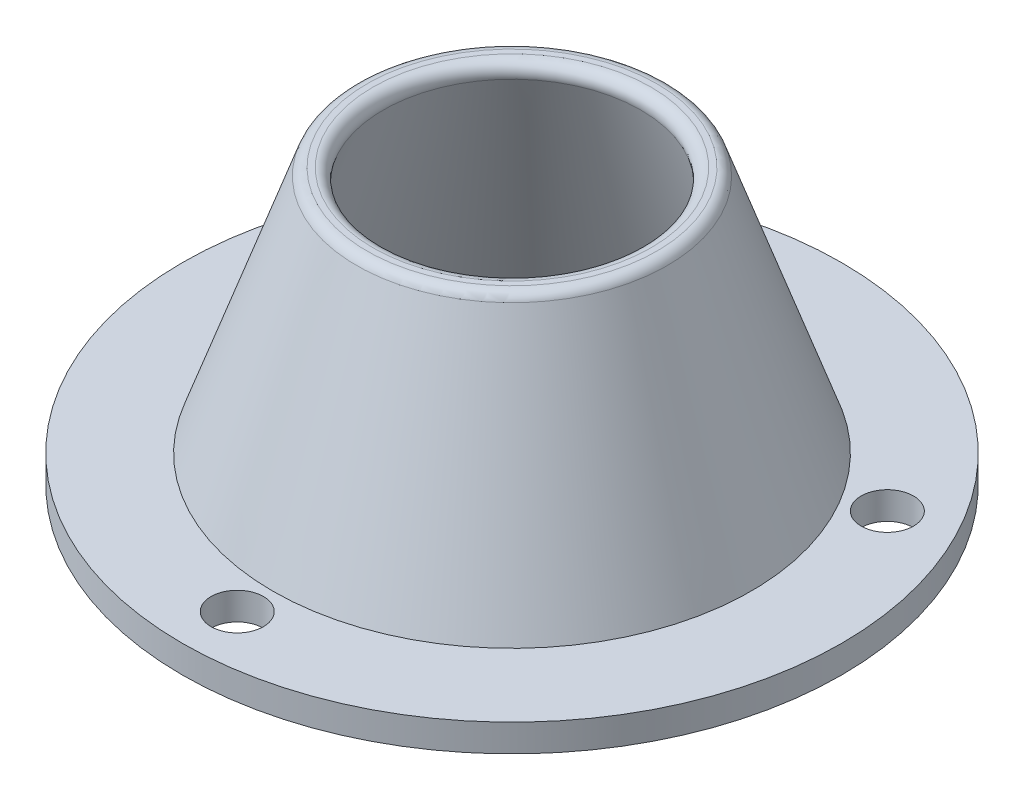
ISO-10303-21;
HEADER;
FILE_DESCRIPTION(('STEP AP214'),'2;1');
FILE_NAME('part.step','',(''),(''),'','','');
FILE_SCHEMA(('AUTOMOTIVE_DESIGN { 1 0 10303 214 1 1 1 1 }'));
ENDSEC;
DATA;
#1=APPLICATION_CONTEXT('core data for automotive mechanical design processes');
#2=APPLICATION_PROTOCOL_DEFINITION('international standard','automotive_design',2000,#1);
#3=PRODUCT_CONTEXT('',#1,'mechanical');
#4=PRODUCT('Part','Part','',(#3));
#5=PRODUCT_RELATED_PRODUCT_CATEGORY('part','',(#4));
#6=PRODUCT_DEFINITION_FORMATION('','',#4);
#7=PRODUCT_DEFINITION_CONTEXT('part definition',#1,'design');
#8=PRODUCT_DEFINITION('design','',#6,#7);
#9=PRODUCT_DEFINITION_SHAPE('','',#8);
#10=(LENGTH_UNIT() NAMED_UNIT(*) SI_UNIT(.MILLI.,.METRE.));
#11=(NAMED_UNIT(*) PLANE_ANGLE_UNIT() SI_UNIT($,.RADIAN.));
#12=(NAMED_UNIT(*) SI_UNIT($,.STERADIAN.) SOLID_ANGLE_UNIT());
#13=UNCERTAINTY_MEASURE_WITH_UNIT(LENGTH_MEASURE(1.E-05),#10,'distance_accuracy_value','');
#14=(GEOMETRIC_REPRESENTATION_CONTEXT(3) GLOBAL_UNCERTAINTY_ASSIGNED_CONTEXT((#13)) GLOBAL_UNIT_ASSIGNED_CONTEXT((#10,
#11,#12)) REPRESENTATION_CONTEXT('',''));
#15=CARTESIAN_POINT('',(0.,0.,0.));
#16=DIRECTION('',(0.,0.,1.));
#17=DIRECTION('',(1.,0.,0.));
#18=AXIS2_PLACEMENT_3D('',#15,#16,#17);
#19=CARTESIAN_POINT('',(0.,47.3392991505438,0.));
#20=DIRECTION('',(0.,-1.,0.));
#21=DIRECTION('',(0.,0.,-1.));
#22=AXIS2_PLACEMENT_3D('',#19,#20,#21);
#23=CONICAL_SURFACE('',#22,23.4312452973097,0.336674819386727);
#24=CARTESIAN_POINT('',(0.,0.,0.));
#25=DIRECTION('',(0.,-1.,0.));
#26=DIRECTION('',(0.,0.,-1.));
#27=AXIS2_PLACEMENT_3D('',#24,#25,#26);
#28=CIRCLE('',#27,40.);
#29=CARTESIAN_POINT('',(0.,0.,-40.));
#30=VERTEX_POINT('',#29);
#31=EDGE_CURVE('E63',#30,#30,#28,.T.);
#32=ORIENTED_EDGE('',*,*,#31,.T.);
#33=EDGE_LOOP('',(#32));
#34=FACE_BOUND('',#33,.T.);
#35=CARTESIAN_POINT('',(0.,47.3392991505438,0.));
#36=DIRECTION('',(0.,-1.,0.));
#37=DIRECTION('',(0.,0.,-1.));
#38=AXIS2_PLACEMENT_3D('',#35,#36,#37);
#39=CIRCLE('',#38,23.4312452973097);
#40=CARTESIAN_POINT('',(0.,47.3392991505438,-23.4312452973097));
#41=VERTEX_POINT('',#40);
#42=EDGE_CURVE('E10',#41,#41,#39,.T.);
#43=ORIENTED_EDGE('',*,*,#42,.F.);
#44=EDGE_LOOP('',(#43));
#45=FACE_BOUND('',#44,.T.);
#46=ADVANCED_FACE('F35',(#34,#45),#23,.F.);
#47=CARTESIAN_POINT('',(0.,48.,0.));
#48=DIRECTION('',(0.,-1.,0.));
#49=DIRECTION('',(0.,0.,-1.));
#50=AXIS2_PLACEMENT_3D('',#47,#48,#49);
#51=TOROIDAL_SURFACE('',#50,25.3189620100417,2.);
#52=ORIENTED_EDGE('',*,*,#42,.T.);
#53=EDGE_LOOP('',(#52));
#54=FACE_BOUND('',#53,.T.);
#55=CARTESIAN_POINT('',(0.,50.,0.));
#56=DIRECTION('',(0.,-1.,0.));
#57=DIRECTION('',(0.,0.,-1.));
#58=AXIS2_PLACEMENT_3D('',#55,#56,#57);
#59=CIRCLE('',#58,25.3189620100417);
#60=CARTESIAN_POINT('',(0.,50.,-25.3189620100417));
#61=VERTEX_POINT('',#60);
#62=EDGE_CURVE('E41',#61,#61,#59,.T.);
#63=ORIENTED_EDGE('',*,*,#62,.F.);
#64=EDGE_LOOP('',(#63));
#65=FACE_BOUND('',#64,.T.);
#66=ADVANCED_FACE('F103',(#54,#65),#51,.T.);
#67=CARTESIAN_POINT('',(26.3784430150626,50.,0.));
#68=DIRECTION('',(0.,1.,0.));
#69=DIRECTION('',(0.,0.,1.));
#70=AXIS2_PLACEMENT_3D('',#67,#68,#69);
#71=PLANE('',#70);
#72=ORIENTED_EDGE('',*,*,#62,.T.);
#73=EDGE_LOOP('',(#72));
#74=FACE_BOUND('',#73,.T.);
#75=CARTESIAN_POINT('',(0.,50.,0.));
#76=DIRECTION('',(0.,-1.,0.));
#77=DIRECTION('',(0.,0.,-1.));
#78=AXIS2_PLACEMENT_3D('',#75,#76,#77);
#79=CIRCLE('',#78,26.3784430150626);
#80=CARTESIAN_POINT('',(0.,50.,-26.3784430150626));
#81=VERTEX_POINT('',#80);
#82=EDGE_CURVE('E45',#81,#81,#79,.T.);
#83=ORIENTED_EDGE('',*,*,#82,.F.);
#84=EDGE_LOOP('',(#83));
#85=FACE_BOUND('',#84,.T.);
#86=ADVANCED_FACE('F107',(#74,#85),#71,.T.);
#87=CARTESIAN_POINT('',(0.,48.,0.));
#88=DIRECTION('',(0.,-1.,0.));
#89=DIRECTION('',(0.,0.,-1.));
#90=AXIS2_PLACEMENT_3D('',#87,#88,#89);
#91=TOROIDAL_SURFACE('',#90,26.3784430150626,2.);
#92=ORIENTED_EDGE('',*,*,#82,.T.);
#93=EDGE_LOOP('',(#92));
#94=FACE_BOUND('',#93,.T.);
#95=CARTESIAN_POINT('',(0.,48.6607008494562,0.));
#96=DIRECTION('',(0.,-1.,0.));
#97=DIRECTION('',(0.,0.,-1.));
#98=AXIS2_PLACEMENT_3D('',#95,#96,#97);
#99=CIRCLE('',#98,28.2661597277946);
#100=CARTESIAN_POINT('',(0.,48.6607008494562,-28.2661597277946));
#101=VERTEX_POINT('',#100);
#102=EDGE_CURVE('E49',#101,#101,#99,.T.);
#103=ORIENTED_EDGE('',*,*,#102,.F.);
#104=EDGE_LOOP('',(#103));
#105=FACE_BOUND('',#104,.T.);
#106=ADVANCED_FACE('F111',(#94,#105),#91,.T.);
#107=CARTESIAN_POINT('',(0.,5.,0.));
#108=DIRECTION('',(0.,-1.,0.));
#109=DIRECTION('',(0.,0.,-1.));
#110=AXIS2_PLACEMENT_3D('',#107,#108,#109);
#111=CONICAL_SURFACE('',#110,43.5474050251043,0.336674819386727);
#112=ORIENTED_EDGE('',*,*,#102,.T.);
#113=EDGE_LOOP('',(#112));
#114=FACE_BOUND('',#113,.T.);
#115=CARTESIAN_POINT('',(0.,5.,0.));
#116=DIRECTION('',(0.,-1.,0.));
#117=DIRECTION('',(0.,0.,-1.));
#118=AXIS2_PLACEMENT_3D('',#115,#116,#117);
#119=CIRCLE('',#118,43.5474050251043);
#120=CARTESIAN_POINT('',(0.,5.,-43.5474050251043));
#121=VERTEX_POINT('',#120);
#122=EDGE_CURVE('E54',#121,#121,#119,.T.);
#123=ORIENTED_EDGE('',*,*,#122,.F.);
#124=EDGE_LOOP('',(#123));
#125=FACE_BOUND('',#124,.T.);
#126=ADVANCED_FACE('F117',(#114,#125),#111,.T.);
#127=CARTESIAN_POINT('',(43.5474050251043,5.,0.));
#128=DIRECTION('',(0.,1.,0.));
#129=DIRECTION('',(0.,0.,1.));
#130=AXIS2_PLACEMENT_3D('',#127,#128,#129);
#131=PLANE('',#130);
#132=CARTESIAN_POINT('',(0.,5.,50.));
#133=DIRECTION('',(0.,1.,0.));
#134=DIRECTION('',(0.,0.,1.));
#135=AXIS2_PLACEMENT_3D('',#132,#133,#134);
#136=CIRCLE('',#135,4.76250000000001);
#137=CARTESIAN_POINT('',(0.,5.,54.7625));
#138=VERTEX_POINT('',#137);
#139=EDGE_CURVE('E66',#138,#138,#136,.T.);
#140=ORIENTED_EDGE('',*,*,#139,.F.);
#141=EDGE_LOOP('',(#140));
#142=FACE_BOUND('',#141,.T.);
#143=CARTESIAN_POINT('',(-43.301270189222,5.,-24.9999999999999));
#144=DIRECTION('',(0.,1.,0.));
#145=DIRECTION('',(0.,0.,1.));
#146=AXIS2_PLACEMENT_3D('',#143,#144,#145);
#147=CIRCLE('',#146,4.7625);
#148=CARTESIAN_POINT('',(-43.301270189222,5.,-20.2374999999999));
#149=VERTEX_POINT('',#148);
#150=EDGE_CURVE('E69',#149,#149,#147,.T.);
#151=ORIENTED_EDGE('',*,*,#150,.F.);
#152=EDGE_LOOP('',(#151));
#153=FACE_BOUND('',#152,.T.);
#154=CARTESIAN_POINT('',(43.3012701892218,5.,-25.));
#155=DIRECTION('',(0.,1.,0.));
#156=DIRECTION('',(0.,0.,1.));
#157=AXIS2_PLACEMENT_3D('',#154,#155,#156);
#158=CIRCLE('',#157,4.7625);
#159=CARTESIAN_POINT('',(43.3012701892218,5.,-20.2375));
#160=VERTEX_POINT('',#159);
#161=EDGE_CURVE('E72',#160,#160,#158,.T.);
#162=ORIENTED_EDGE('',*,*,#161,.F.);
#163=EDGE_LOOP('',(#162));
#164=FACE_BOUND('',#163,.T.);
#165=ORIENTED_EDGE('',*,*,#122,.T.);
#166=EDGE_LOOP('',(#165));
#167=FACE_BOUND('',#166,.T.);
#168=CARTESIAN_POINT('',(0.,5.,0.));
#169=DIRECTION('',(0.,-1.,0.));
#170=DIRECTION('',(0.,0.,-1.));
#171=AXIS2_PLACEMENT_3D('',#168,#169,#170);
#172=CIRCLE('',#171,60.);
#173=CARTESIAN_POINT('',(0.,5.,-60.));
#174=VERTEX_POINT('',#173);
#175=EDGE_CURVE('E57',#174,#174,#172,.T.);
#176=ORIENTED_EDGE('',*,*,#175,.F.);
#177=EDGE_LOOP('',(#176));
#178=FACE_BOUND('',#177,.T.);
#179=ADVANCED_FACE('F121',(#142,#153,#164,#167,#178),#131,.T.);
#180=CARTESIAN_POINT('',(0.,0.,0.));
#181=DIRECTION('',(0.,-1.,0.));
#182=DIRECTION('',(0.,0.,-1.));
#183=AXIS2_PLACEMENT_3D('',#180,#181,#182);
#184=CYLINDRICAL_SURFACE('',#183,60.);
#185=ORIENTED_EDGE('',*,*,#175,.T.);
#186=EDGE_LOOP('',(#185));
#187=FACE_BOUND('',#186,.T.);
#188=CARTESIAN_POINT('',(0.,0.,0.));
#189=DIRECTION('',(0.,-1.,0.));
#190=DIRECTION('',(0.,0.,-1.));
#191=AXIS2_PLACEMENT_3D('',#188,#189,#190);
#192=CIRCLE('',#191,60.);
#193=CARTESIAN_POINT('',(0.,0.,-60.));
#194=VERTEX_POINT('',#193);
#195=EDGE_CURVE('E60',#194,#194,#192,.T.);
#196=ORIENTED_EDGE('',*,*,#195,.F.);
#197=EDGE_LOOP('',(#196));
#198=FACE_BOUND('',#197,.T.);
#199=ADVANCED_FACE('F91',(#187,#198),#184,.T.);
#200=CARTESIAN_POINT('',(40.,0.,0.));
#201=DIRECTION('',(0.,-1.,0.));
#202=DIRECTION('',(0.,0.,-1.));
#203=AXIS2_PLACEMENT_3D('',#200,#201,#202);
#204=PLANE('',#203);
#205=CARTESIAN_POINT('',(0.,0.,50.));
#206=DIRECTION('',(0.,-1.,0.));
#207=DIRECTION('',(0.,0.,-1.));
#208=AXIS2_PLACEMENT_3D('',#205,#206,#207);
#209=CIRCLE('',#208,4.76250000000001);
#210=CARTESIAN_POINT('',(0.,0.,45.2375));
#211=VERTEX_POINT('',#210);
#212=EDGE_CURVE('E75',#211,#211,#209,.T.);
#213=ORIENTED_EDGE('',*,*,#212,.F.);
#214=EDGE_LOOP('',(#213));
#215=FACE_BOUND('',#214,.T.);
#216=CARTESIAN_POINT('',(-43.301270189222,0.,-24.9999999999999));
#217=DIRECTION('',(0.,-1.,0.));
#218=DIRECTION('',(0.,0.,-1.));
#219=AXIS2_PLACEMENT_3D('',#216,#217,#218);
#220=CIRCLE('',#219,4.7625);
#221=CARTESIAN_POINT('',(-43.301270189222,0.,-29.7624999999999));
#222=VERTEX_POINT('',#221);
#223=EDGE_CURVE('E79',#222,#222,#220,.T.);
#224=ORIENTED_EDGE('',*,*,#223,.F.);
#225=EDGE_LOOP('',(#224));
#226=FACE_BOUND('',#225,.T.);
#227=CARTESIAN_POINT('',(43.3012701892218,0.,-25.));
#228=DIRECTION('',(0.,-1.,0.));
#229=DIRECTION('',(0.,0.,-1.));
#230=AXIS2_PLACEMENT_3D('',#227,#228,#229);
#231=CIRCLE('',#230,4.7625);
#232=CARTESIAN_POINT('',(43.3012701892218,0.,-29.7625));
#233=VERTEX_POINT('',#232);
#234=EDGE_CURVE('E76',#233,#233,#231,.T.);
#235=ORIENTED_EDGE('',*,*,#234,.F.);
#236=EDGE_LOOP('',(#235));
#237=FACE_BOUND('',#236,.T.);
#238=ORIENTED_EDGE('',*,*,#195,.T.);
#239=EDGE_LOOP('',(#238));
#240=FACE_BOUND('',#239,.T.);
#241=ORIENTED_EDGE('',*,*,#31,.F.);
#242=EDGE_LOOP('',(#241));
#243=FACE_BOUND('',#242,.T.);
#244=ADVANCED_FACE('F87',(#215,#226,#237,#240,#243),#204,.T.);
#245=CARTESIAN_POINT('',(43.3012701892218,10.,-25.));
#246=DIRECTION('',(0.,-1.,0.));
#247=DIRECTION('',(0.,0.,-1.));
#248=AXIS2_PLACEMENT_3D('',#245,#246,#247);
#249=CYLINDRICAL_SURFACE('',#248,4.7625);
#250=ORIENTED_EDGE('',*,*,#161,.T.);
#251=EDGE_LOOP('',(#250));
#252=FACE_BOUND('',#251,.T.);
#253=ORIENTED_EDGE('',*,*,#234,.T.);
#254=EDGE_LOOP('',(#253));
#255=FACE_BOUND('',#254,.T.);
#256=ADVANCED_FACE('F90',(#252,#255),#249,.F.);
#257=CARTESIAN_POINT('',(-43.301270189222,10.,-24.9999999999999));
#258=DIRECTION('',(0.,-1.,0.));
#259=DIRECTION('',(0.,0.,-1.));
#260=AXIS2_PLACEMENT_3D('',#257,#258,#259);
#261=CYLINDRICAL_SURFACE('',#260,4.7625);
#262=ORIENTED_EDGE('',*,*,#150,.T.);
#263=EDGE_LOOP('',(#262));
#264=FACE_BOUND('',#263,.T.);
#265=ORIENTED_EDGE('',*,*,#223,.T.);
#266=EDGE_LOOP('',(#265));
#267=FACE_BOUND('',#266,.T.);
#268=ADVANCED_FACE('F131',(#264,#267),#261,.F.);
#269=CARTESIAN_POINT('',(0.,10.,50.));
#270=DIRECTION('',(0.,-1.,0.));
#271=DIRECTION('',(0.,0.,-1.));
#272=AXIS2_PLACEMENT_3D('',#269,#270,#271);
#273=CYLINDRICAL_SURFACE('',#272,4.76250000000001);
#274=ORIENTED_EDGE('',*,*,#139,.T.);
#275=EDGE_LOOP('',(#274));
#276=FACE_BOUND('',#275,.T.);
#277=ORIENTED_EDGE('',*,*,#212,.T.);
#278=EDGE_LOOP('',(#277));
#279=FACE_BOUND('',#278,.T.);
#280=ADVANCED_FACE('F85',(#276,#279),#273,.F.);
#281=CLOSED_SHELL('',(#46,#66,#86,#106,#126,#179,#199,#244,#256,#268,#280));
#282=MANIFOLD_SOLID_BREP('B2',#281);
#283=ADVANCED_BREP_SHAPE_REPRESENTATION('',(#18,#282),#14);
#284=SHAPE_DEFINITION_REPRESENTATION(#9,#283);
ENDSEC;
END-ISO-10303-21;
